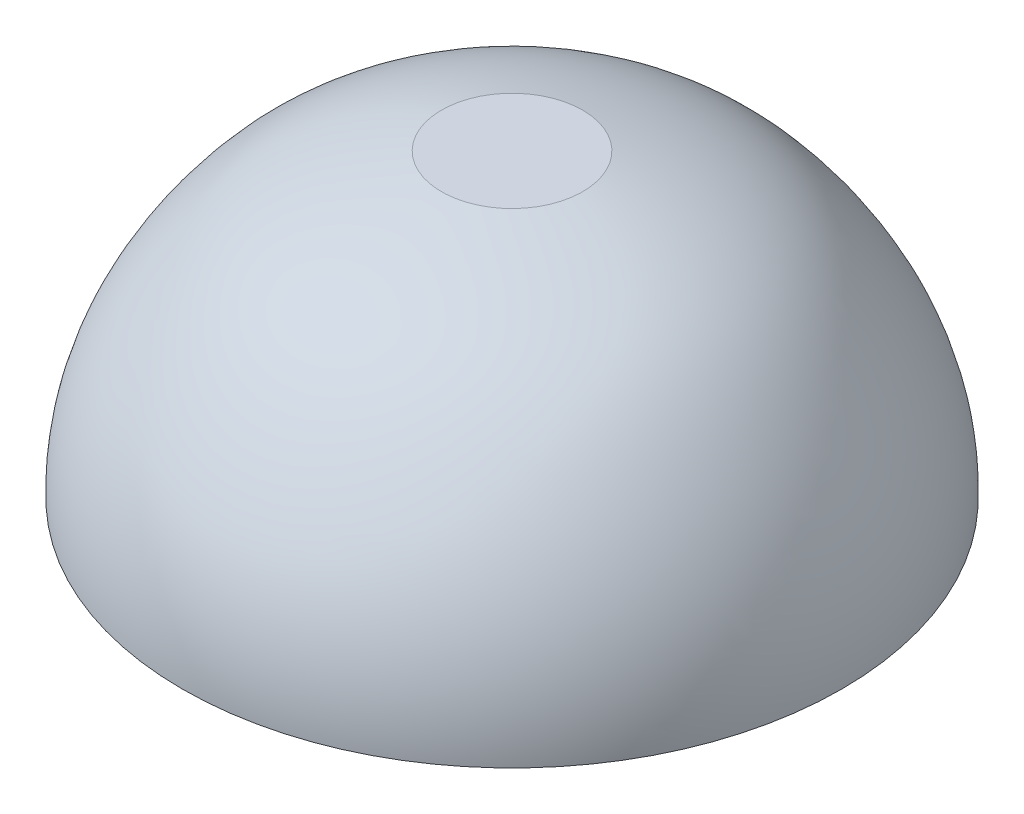
ISO-10303-21;
HEADER;
FILE_DESCRIPTION(('STEP AP214'),'2;1');
FILE_NAME('part.step','',(''),(''),'','','');
FILE_SCHEMA(('AUTOMOTIVE_DESIGN { 1 0 10303 214 1 1 1 1 }'));
ENDSEC;
DATA;
#1=APPLICATION_CONTEXT('core data for automotive mechanical design processes');
#2=APPLICATION_PROTOCOL_DEFINITION('international standard','automotive_design',2000,#1);
#3=PRODUCT_CONTEXT('',#1,'mechanical');
#4=PRODUCT('Part','Part','',(#3));
#5=PRODUCT_RELATED_PRODUCT_CATEGORY('part','',(#4));
#6=PRODUCT_DEFINITION_FORMATION('','',#4);
#7=PRODUCT_DEFINITION_CONTEXT('part definition',#1,'design');
#8=PRODUCT_DEFINITION('design','',#6,#7);
#9=PRODUCT_DEFINITION_SHAPE('','',#8);
#10=(LENGTH_UNIT() NAMED_UNIT(*) SI_UNIT(.MILLI.,.METRE.));
#11=(NAMED_UNIT(*) PLANE_ANGLE_UNIT() SI_UNIT($,.RADIAN.));
#12=(NAMED_UNIT(*) SI_UNIT($,.STERADIAN.) SOLID_ANGLE_UNIT());
#13=UNCERTAINTY_MEASURE_WITH_UNIT(LENGTH_MEASURE(1.E-05),#10,'distance_accuracy_value','');
#14=(GEOMETRIC_REPRESENTATION_CONTEXT(3) GLOBAL_UNCERTAINTY_ASSIGNED_CONTEXT((#13)) GLOBAL_UNIT_ASSIGNED_CONTEXT((#10,
#11,#12)) REPRESENTATION_CONTEXT('',''));
#15=CARTESIAN_POINT('',(0.,0.,0.));
#16=DIRECTION('',(0.,0.,1.));
#17=DIRECTION('',(1.,0.,0.));
#18=AXIS2_PLACEMENT_3D('',#15,#16,#17);
#19=CARTESIAN_POINT('',(29.8868118719822,127.,0.));
#20=CARTESIAN_POINT('',(44.4329937192612,123.661749797372,0.));
#21=CARTESIAN_POINT('',(59.4600695965972,119.177364974383,0.));
#22=CARTESIAN_POINT('',(76.3802162825854,110.552780869151,0.));
#23=CARTESIAN_POINT('',(79.6711653986904,108.677112641996,0.));
#24=CARTESIAN_POINT('',(84.422549965413,105.608187262072,0.));
#25=CARTESIAN_POINT('',(85.9755118883935,104.542641875036,0.));
#26=CARTESIAN_POINT('',(89.0122960555895,102.321504935741,0.));
#27=CARTESIAN_POINT('',(90.4951707596923,101.165037474816,0.));
#28=CARTESIAN_POINT('',(97.7393856845095,95.1560315878875,0.));
#29=CARTESIAN_POINT('',(102.992721730063,89.6397027291977,0.));
#30=CARTESIAN_POINT('',(109.009496987695,82.2474176647865,0.));
#31=CARTESIAN_POINT('',(110.185400974135,80.7441028935997,0.));
#32=CARTESIAN_POINT('',(112.485234630238,77.6979000253078,0.));
#33=CARTESIAN_POINT('',(113.608562564087,76.1554974018456,0.));
#34=CARTESIAN_POINT('',(116.89329072223,71.4725221185557,0.));
#35=CARTESIAN_POINT('',(118.969431325965,68.2761832175255,0.));
#36=CARTESIAN_POINT('',(124.813040843106,58.481166274015,0.));
#37=CARTESIAN_POINT('',(128.195628136789,51.6765538497008,0.));
#38=CARTESIAN_POINT('',(136.456109379892,30.5740358809839,0.));
#39=CARTESIAN_POINT('',(139.447346625365,15.5902478947314,0.));
#40=CARTESIAN_POINT('',(139.000412177218,0.028708614482394,0.));
#41=B_SPLINE_CURVE_WITH_KNOTS('',3,(#19,#20,#21,#22,#23,#24,#25,#26,#27,#28,#29,#30,#31,#32,#33,
#34,#35,#36,#37,#38,#39,#40),.UNSPECIFIED.,.F.,.F.,(4,2,2,2,2,2,2,2,2,2,4),(0.,0.25,0.3125,
0.34375,0.375,0.5,0.53125,0.5625,0.625,0.75,1.),.UNSPECIFIED.);
#42=CARTESIAN_POINT('',(0.,0.,0.));
#43=DIRECTION('',(0.,-1.,0.));
#44=AXIS1_PLACEMENT('',#42,#43);
#45=SURFACE_OF_REVOLUTION('',#41,#44);
#46=CARTESIAN_POINT('',(0.,0.028708614482394,0.));
#47=DIRECTION('',(0.,-1.,0.));
#48=DIRECTION('',(0.,0.,-1.));
#49=AXIS2_PLACEMENT_3D('',#46,#47,#48);
#50=CIRCLE('',#49,139.000412177218);
#51=CARTESIAN_POINT('',(0.,0.028708614482394,-139.000412177218));
#52=VERTEX_POINT('',#51);
#53=EDGE_CURVE('E10',#52,#52,#50,.T.);
#54=ORIENTED_EDGE('',*,*,#53,.T.);
#55=EDGE_LOOP('',(#54));
#56=FACE_BOUND('',#55,.T.);
#57=CARTESIAN_POINT('',(0.,127.,0.));
#58=DIRECTION('',(0.,-1.,0.));
#59=DIRECTION('',(0.,0.,-1.));
#60=AXIS2_PLACEMENT_3D('',#57,#58,#59);
#61=CIRCLE('',#60,29.8868118719822);
#62=CARTESIAN_POINT('',(0.,127.,-29.8868118719822));
#63=VERTEX_POINT('',#62);
#64=EDGE_CURVE('E46',#63,#63,#61,.T.);
#65=ORIENTED_EDGE('',*,*,#64,.F.);
#66=EDGE_LOOP('',(#65));
#67=FACE_BOUND('',#66,.T.);
#68=ADVANCED_FACE('F31',(#56,#67),#45,.F.);
#69=CARTESIAN_POINT('',(0.,0.,0.));
#70=DIRECTION('',(0.,-1.,0.));
#71=DIRECTION('',(0.,0.,-1.));
#72=AXIS2_PLACEMENT_3D('',#69,#70,#71);
#73=CONICAL_SURFACE('',#72,140.,1.54208376731644);
#74=ORIENTED_EDGE('',*,*,#53,.F.);
#75=EDGE_LOOP('',(#74));
#76=FACE_BOUND('',#75,.T.);
#77=CARTESIAN_POINT('',(0.,0.,0.));
#78=DIRECTION('',(0.,-1.,0.));
#79=DIRECTION('',(0.,0.,-1.));
#80=AXIS2_PLACEMENT_3D('',#77,#78,#79);
#81=CIRCLE('',#80,140.);
#82=CARTESIAN_POINT('',(0.,0.,-140.));
#83=VERTEX_POINT('',#82);
#84=EDGE_CURVE('E38',#83,#83,#81,.T.);
#85=ORIENTED_EDGE('',*,*,#84,.T.);
#86=EDGE_LOOP('',(#85));
#87=FACE_BOUND('',#86,.T.);
#88=ADVANCED_FACE('F65',(#76,#87),#73,.F.);
#89=CARTESIAN_POINT('',(30.,128.,0.));
#90=CARTESIAN_POINT('',(50.8605555704642,123.220105799841,0.));
#91=CARTESIAN_POINT('',(83.3987409459128,112.633479794389,0.));
#92=CARTESIAN_POINT('',(125.219327377445,67.0956026553862,0.));
#93=CARTESIAN_POINT('',(140.848054586459,29.5278979136491,0.));
#94=CARTESIAN_POINT('',(140.,0.,0.));
#95=B_SPLINE_CURVE_WITH_KNOTS('',3,(#89,#90,#91,#92,#93,#94),.UNSPECIFIED.,.F.,.F.,(4,1,1,4),
(0.,0.35728447882746,0.530346239110189,1.),.UNSPECIFIED.);
#96=CARTESIAN_POINT('',(0.,0.,0.));
#97=DIRECTION('',(0.,-1.,0.));
#98=AXIS1_PLACEMENT('',#96,#97);
#99=SURFACE_OF_REVOLUTION('',#95,#98);
#100=ORIENTED_EDGE('',*,*,#84,.F.);
#101=EDGE_LOOP('',(#100));
#102=FACE_BOUND('',#101,.T.);
#103=CARTESIAN_POINT('',(0.,128.,0.));
#104=DIRECTION('',(0.,-1.,0.));
#105=DIRECTION('',(0.,0.,-1.));
#106=AXIS2_PLACEMENT_3D('',#103,#104,#105);
#107=CIRCLE('',#106,30.);
#108=CARTESIAN_POINT('',(0.,128.,-30.));
#109=VERTEX_POINT('',#108);
#110=EDGE_CURVE('E42',#109,#109,#107,.T.);
#111=ORIENTED_EDGE('',*,*,#110,.T.);
#112=EDGE_LOOP('',(#111));
#113=FACE_BOUND('',#112,.T.);
#114=ADVANCED_FACE('F61',(#102,#113),#99,.T.);
#115=CARTESIAN_POINT('',(0.,128.,0.));
#116=DIRECTION('',(0.,-1.,0.));
#117=DIRECTION('',(0.,0.,-1.));
#118=AXIS2_PLACEMENT_3D('',#115,#116,#117);
#119=PLANE('',#118);
#120=ORIENTED_EDGE('',*,*,#110,.F.);
#121=EDGE_LOOP('',(#120));
#122=FACE_BOUND('',#121,.T.);
#123=ADVANCED_FACE('F64',(#122),#119,.F.);
#124=CARTESIAN_POINT('',(0.,127.,0.));
#125=DIRECTION('',(0.,-1.,0.));
#126=DIRECTION('',(0.,0.,-1.));
#127=AXIS2_PLACEMENT_3D('',#124,#125,#126);
#128=PLANE('',#127);
#129=ORIENTED_EDGE('',*,*,#64,.T.);
#130=EDGE_LOOP('',(#129));
#131=FACE_BOUND('',#130,.T.);
#132=ADVANCED_FACE('F78',(#131),#128,.T.);
#133=CLOSED_SHELL('',(#68,#88,#114,#123,#132));
#134=MANIFOLD_SOLID_BREP('B2',#133);
#135=ADVANCED_BREP_SHAPE_REPRESENTATION('',(#18,#134),#14);
#136=SHAPE_DEFINITION_REPRESENTATION(#9,#135);
ENDSEC;
END-ISO-10303-21;
